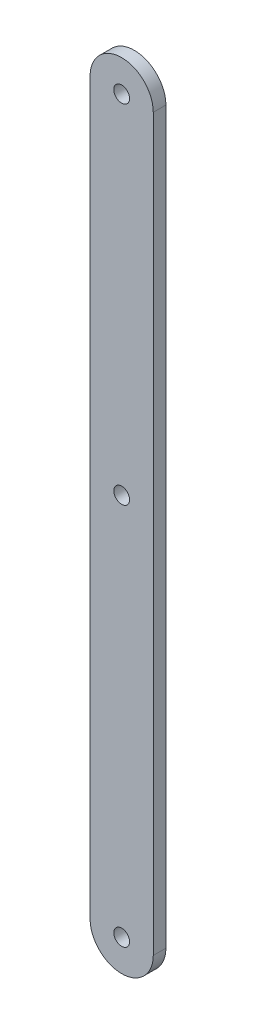
ISO-10303-21;
HEADER;
FILE_DESCRIPTION(('STEP AP214'),'2;1');
FILE_NAME('part.step','',(''),(''),'','','');
FILE_SCHEMA(('AUTOMOTIVE_DESIGN { 1 0 10303 214 1 1 1 1 }'));
ENDSEC;
DATA;
#1=APPLICATION_CONTEXT('core data for automotive mechanical design processes');
#2=APPLICATION_PROTOCOL_DEFINITION('international standard','automotive_design',2000,#1);
#3=PRODUCT_CONTEXT('',#1,'mechanical');
#4=PRODUCT('Part','Part','',(#3));
#5=PRODUCT_RELATED_PRODUCT_CATEGORY('part','',(#4));
#6=PRODUCT_DEFINITION_FORMATION('','',#4);
#7=PRODUCT_DEFINITION_CONTEXT('part definition',#1,'design');
#8=PRODUCT_DEFINITION('design','',#6,#7);
#9=PRODUCT_DEFINITION_SHAPE('','',#8);
#10=(LENGTH_UNIT() NAMED_UNIT(*) SI_UNIT(.MILLI.,.METRE.));
#11=(NAMED_UNIT(*) PLANE_ANGLE_UNIT() SI_UNIT($,.RADIAN.));
#12=(NAMED_UNIT(*) SI_UNIT($,.STERADIAN.) SOLID_ANGLE_UNIT());
#13=UNCERTAINTY_MEASURE_WITH_UNIT(LENGTH_MEASURE(1.E-05),#10,'distance_accuracy_value','');
#14=(GEOMETRIC_REPRESENTATION_CONTEXT(3) GLOBAL_UNCERTAINTY_ASSIGNED_CONTEXT((#13)) GLOBAL_UNIT_ASSIGNED_CONTEXT((#10,
#11,#12)) REPRESENTATION_CONTEXT('',''));
#15=CARTESIAN_POINT('',(0.,0.,0.));
#16=DIRECTION('',(0.,0.,1.));
#17=DIRECTION('',(1.,0.,0.));
#18=AXIS2_PLACEMENT_3D('',#15,#16,#17);
#19=CARTESIAN_POINT('',(0.,0.,2.54));
#20=DIRECTION('',(0.,0.,1.));
#21=DIRECTION('',(1.,0.,0.));
#22=AXIS2_PLACEMENT_3D('',#19,#20,#21);
#23=PLANE('',#22);
#24=CARTESIAN_POINT('',(0.,76.962,2.54));
#25=DIRECTION('',(0.,0.,1.));
#26=DIRECTION('',(1.,0.,0.));
#27=AXIS2_PLACEMENT_3D('',#24,#25,#26);
#28=CIRCLE('',#27,1.5875);
#29=CARTESIAN_POINT('',(1.5875,76.962,2.54));
#30=VERTEX_POINT('',#29);
#31=EDGE_CURVE('E114',#30,#30,#28,.T.);
#32=ORIENTED_EDGE('',*,*,#31,.F.);
#33=EDGE_LOOP('',(#32));
#34=FACE_BOUND('',#33,.T.);
#35=CARTESIAN_POINT('',(0.,0.,2.54));
#36=DIRECTION('',(0.,0.,1.));
#37=DIRECTION('',(1.,0.,0.));
#38=AXIS2_PLACEMENT_3D('',#35,#36,#37);
#39=CIRCLE('',#38,6.35);
#40=CARTESIAN_POINT('',(-6.35,0.,2.54));
#41=VERTEX_POINT('',#40);
#42=CARTESIAN_POINT('',(6.35,0.,2.54));
#43=VERTEX_POINT('',#42);
#44=EDGE_CURVE('E84',#41,#43,#39,.T.);
#45=ORIENTED_EDGE('',*,*,#44,.T.);
#46=DIRECTION('',(0.,1.,0.));
#47=VECTOR('',#46,1.);
#48=CARTESIAN_POINT('',(6.35,0.,2.54));
#49=LINE('',#48,#47);
#50=CARTESIAN_POINT('',(6.35,146.812,2.54));
#51=VERTEX_POINT('',#50);
#52=EDGE_CURVE('E79',#43,#51,#49,.T.);
#53=ORIENTED_EDGE('',*,*,#52,.T.);
#54=CARTESIAN_POINT('',(0.,146.812,2.54));
#55=DIRECTION('',(0.,0.,1.));
#56=DIRECTION('',(1.,0.,0.));
#57=AXIS2_PLACEMENT_3D('',#54,#55,#56);
#58=CIRCLE('',#57,6.35);
#59=CARTESIAN_POINT('',(-6.35,146.812,2.54));
#60=VERTEX_POINT('',#59);
#61=EDGE_CURVE('E82',#51,#60,#58,.T.);
#62=ORIENTED_EDGE('',*,*,#61,.T.);
#63=DIRECTION('',(0.,-1.,0.));
#64=VECTOR('',#63,1.);
#65=CARTESIAN_POINT('',(-6.35,0.,2.54));
#66=LINE('',#65,#64);
#67=EDGE_CURVE('E49',#60,#41,#66,.T.);
#68=ORIENTED_EDGE('',*,*,#67,.T.);
#69=EDGE_LOOP('',(#45,#53,#62,#68));
#70=FACE_BOUND('',#69,.T.);
#71=CARTESIAN_POINT('',(0.,0.,2.54));
#72=DIRECTION('',(0.,0.,1.));
#73=DIRECTION('',(1.,0.,0.));
#74=AXIS2_PLACEMENT_3D('',#71,#72,#73);
#75=CIRCLE('',#74,1.5875);
#76=CARTESIAN_POINT('',(1.5875,0.,2.54));
#77=VERTEX_POINT('',#76);
#78=EDGE_CURVE('E99',#77,#77,#75,.T.);
#79=ORIENTED_EDGE('',*,*,#78,.F.);
#80=EDGE_LOOP('',(#79));
#81=FACE_BOUND('',#80,.T.);
#82=CARTESIAN_POINT('',(0.,146.812,2.54));
#83=DIRECTION('',(0.,0.,1.));
#84=DIRECTION('',(1.,0.,0.));
#85=AXIS2_PLACEMENT_3D('',#82,#83,#84);
#86=CIRCLE('',#85,1.5875);
#87=CARTESIAN_POINT('',(1.5875,146.812,2.54));
#88=VERTEX_POINT('',#87);
#89=EDGE_CURVE('E120',#88,#88,#86,.T.);
#90=ORIENTED_EDGE('',*,*,#89,.F.);
#91=EDGE_LOOP('',(#90));
#92=FACE_BOUND('',#91,.T.);
#93=ADVANCED_FACE('F32',(#34,#70,#81,#92),#23,.T.);
#94=CARTESIAN_POINT('',(0.,0.,0.));
#95=DIRECTION('',(0.,0.,1.));
#96=DIRECTION('',(1.,0.,0.));
#97=AXIS2_PLACEMENT_3D('',#94,#95,#96);
#98=PLANE('',#97);
#99=CARTESIAN_POINT('',(0.,0.,0.));
#100=DIRECTION('',(0.,0.,1.));
#101=DIRECTION('',(1.,0.,0.));
#102=AXIS2_PLACEMENT_3D('',#99,#100,#101);
#103=CIRCLE('',#102,6.35);
#104=CARTESIAN_POINT('',(-6.35,0.,0.));
#105=VERTEX_POINT('',#104);
#106=CARTESIAN_POINT('',(6.35,0.,0.));
#107=VERTEX_POINT('',#106);
#108=EDGE_CURVE('E96',#105,#107,#103,.T.);
#109=ORIENTED_EDGE('',*,*,#108,.F.);
#110=DIRECTION('',(0.,-1.,0.));
#111=VECTOR('',#110,1.);
#112=CARTESIAN_POINT('',(-6.35,0.,0.));
#113=LINE('',#112,#111);
#114=CARTESIAN_POINT('',(-6.35,146.812,0.));
#115=VERTEX_POINT('',#114);
#116=EDGE_CURVE('E72',#115,#105,#113,.T.);
#117=ORIENTED_EDGE('',*,*,#116,.F.);
#118=CARTESIAN_POINT('',(0.,146.812,0.));
#119=DIRECTION('',(0.,0.,1.));
#120=DIRECTION('',(1.,0.,0.));
#121=AXIS2_PLACEMENT_3D('',#118,#119,#120);
#122=CIRCLE('',#121,6.35);
#123=CARTESIAN_POINT('',(6.35,146.812,0.));
#124=VERTEX_POINT('',#123);
#125=EDGE_CURVE('E66',#124,#115,#122,.T.);
#126=ORIENTED_EDGE('',*,*,#125,.F.);
#127=DIRECTION('',(0.,1.,0.));
#128=VECTOR('',#127,1.);
#129=CARTESIAN_POINT('',(6.35,0.,0.));
#130=LINE('',#129,#128);
#131=EDGE_CURVE('E88',#107,#124,#130,.T.);
#132=ORIENTED_EDGE('',*,*,#131,.F.);
#133=EDGE_LOOP('',(#109,#117,#126,#132));
#134=FACE_BOUND('',#133,.T.);
#135=CARTESIAN_POINT('',(0.,0.,0.));
#136=DIRECTION('',(0.,0.,1.));
#137=DIRECTION('',(1.,0.,0.));
#138=AXIS2_PLACEMENT_3D('',#135,#136,#137);
#139=CIRCLE('',#138,1.5875);
#140=CARTESIAN_POINT('',(1.5875,0.,0.));
#141=VERTEX_POINT('',#140);
#142=EDGE_CURVE('E111',#141,#141,#139,.T.);
#143=ORIENTED_EDGE('',*,*,#142,.T.);
#144=EDGE_LOOP('',(#143));
#145=FACE_BOUND('',#144,.T.);
#146=CARTESIAN_POINT('',(0.,76.962,0.));
#147=DIRECTION('',(0.,0.,1.));
#148=DIRECTION('',(1.,0.,0.));
#149=AXIS2_PLACEMENT_3D('',#146,#147,#148);
#150=CIRCLE('',#149,1.5875);
#151=CARTESIAN_POINT('',(1.5875,76.962,0.));
#152=VERTEX_POINT('',#151);
#153=EDGE_CURVE('E117',#152,#152,#150,.T.);
#154=ORIENTED_EDGE('',*,*,#153,.T.);
#155=EDGE_LOOP('',(#154));
#156=FACE_BOUND('',#155,.T.);
#157=CARTESIAN_POINT('',(0.,146.812,0.));
#158=DIRECTION('',(0.,0.,1.));
#159=DIRECTION('',(1.,0.,0.));
#160=AXIS2_PLACEMENT_3D('',#157,#158,#159);
#161=CIRCLE('',#160,1.5875);
#162=CARTESIAN_POINT('',(1.5875,146.812,0.));
#163=VERTEX_POINT('',#162);
#164=EDGE_CURVE('E123',#163,#163,#161,.T.);
#165=ORIENTED_EDGE('',*,*,#164,.T.);
#166=EDGE_LOOP('',(#165));
#167=FACE_BOUND('',#166,.T.);
#168=ADVANCED_FACE('F107',(#134,#145,#156,#167),#98,.F.);
#169=CARTESIAN_POINT('',(0.,0.,2.54));
#170=DIRECTION('',(0.,0.,-1.));
#171=DIRECTION('',(-1.,0.,0.));
#172=AXIS2_PLACEMENT_3D('',#169,#170,#171);
#173=CYLINDRICAL_SURFACE('',#172,6.35);
#174=ORIENTED_EDGE('',*,*,#108,.T.);
#175=DIRECTION('',(0.,0.,-1.));
#176=VECTOR('',#175,1.);
#177=CARTESIAN_POINT('',(6.35,0.,2.54));
#178=LINE('',#177,#176);
#179=EDGE_CURVE('E11',#43,#107,#178,.T.);
#180=ORIENTED_EDGE('',*,*,#179,.F.);
#181=ORIENTED_EDGE('',*,*,#44,.F.);
#182=DIRECTION('',(0.,0.,-1.));
#183=VECTOR('',#182,1.);
#184=CARTESIAN_POINT('',(-6.35,0.,2.54));
#185=LINE('',#184,#183);
#186=EDGE_CURVE('E92',#41,#105,#185,.T.);
#187=ORIENTED_EDGE('',*,*,#186,.T.);
#188=EDGE_LOOP('',(#174,#180,#181,#187));
#189=FACE_BOUND('',#188,.T.);
#190=ADVANCED_FACE('F34',(#189),#173,.T.);
#191=CARTESIAN_POINT('',(6.35,0.,2.54));
#192=DIRECTION('',(-1.,0.,0.));
#193=DIRECTION('',(0.,0.,1.));
#194=AXIS2_PLACEMENT_3D('',#191,#192,#193);
#195=PLANE('',#194);
#196=ORIENTED_EDGE('',*,*,#131,.T.);
#197=DIRECTION('',(0.,0.,-1.));
#198=VECTOR('',#197,1.);
#199=CARTESIAN_POINT('',(6.35,146.812,2.54));
#200=LINE('',#199,#198);
#201=EDGE_CURVE('E41',#51,#124,#200,.T.);
#202=ORIENTED_EDGE('',*,*,#201,.F.);
#203=ORIENTED_EDGE('',*,*,#52,.F.);
#204=ORIENTED_EDGE('',*,*,#179,.T.);
#205=EDGE_LOOP('',(#196,#202,#203,#204));
#206=FACE_BOUND('',#205,.T.);
#207=ADVANCED_FACE('F87',(#206),#195,.F.);
#208=CARTESIAN_POINT('',(0.,146.812,2.54));
#209=DIRECTION('',(0.,0.,-1.));
#210=DIRECTION('',(-1.,0.,0.));
#211=AXIS2_PLACEMENT_3D('',#208,#209,#210);
#212=CYLINDRICAL_SURFACE('',#211,6.35);
#213=ORIENTED_EDGE('',*,*,#125,.T.);
#214=DIRECTION('',(0.,0.,-1.));
#215=VECTOR('',#214,1.);
#216=CARTESIAN_POINT('',(-6.35,146.812,2.54));
#217=LINE('',#216,#215);
#218=EDGE_CURVE('E89',#60,#115,#217,.T.);
#219=ORIENTED_EDGE('',*,*,#218,.F.);
#220=ORIENTED_EDGE('',*,*,#61,.F.);
#221=ORIENTED_EDGE('',*,*,#201,.T.);
#222=EDGE_LOOP('',(#213,#219,#220,#221));
#223=FACE_BOUND('',#222,.T.);
#224=ADVANCED_FACE('F90',(#223),#212,.T.);
#225=CARTESIAN_POINT('',(-6.35,0.,2.54));
#226=DIRECTION('',(1.,0.,0.));
#227=DIRECTION('',(0.,0.,-1.));
#228=AXIS2_PLACEMENT_3D('',#225,#226,#227);
#229=PLANE('',#228);
#230=ORIENTED_EDGE('',*,*,#116,.T.);
#231=ORIENTED_EDGE('',*,*,#186,.F.);
#232=ORIENTED_EDGE('',*,*,#67,.F.);
#233=ORIENTED_EDGE('',*,*,#218,.T.);
#234=EDGE_LOOP('',(#230,#231,#232,#233));
#235=FACE_BOUND('',#234,.T.);
#236=ADVANCED_FACE('F104',(#235),#229,.F.);
#237=CARTESIAN_POINT('',(0.,0.,2.54));
#238=DIRECTION('',(0.,0.,-1.));
#239=DIRECTION('',(-1.,0.,0.));
#240=AXIS2_PLACEMENT_3D('',#237,#238,#239);
#241=CYLINDRICAL_SURFACE('',#240,1.5875);
#242=ORIENTED_EDGE('',*,*,#78,.T.);
#243=EDGE_LOOP('',(#242));
#244=FACE_BOUND('',#243,.T.);
#245=ORIENTED_EDGE('',*,*,#142,.F.);
#246=EDGE_LOOP('',(#245));
#247=FACE_BOUND('',#246,.T.);
#248=ADVANCED_FACE('F141',(#244,#247),#241,.F.);
#249=CARTESIAN_POINT('',(0.,76.962,2.54));
#250=DIRECTION('',(0.,0.,-1.));
#251=DIRECTION('',(-1.,0.,0.));
#252=AXIS2_PLACEMENT_3D('',#249,#250,#251);
#253=CYLINDRICAL_SURFACE('',#252,1.5875);
#254=ORIENTED_EDGE('',*,*,#31,.T.);
#255=EDGE_LOOP('',(#254));
#256=FACE_BOUND('',#255,.T.);
#257=ORIENTED_EDGE('',*,*,#153,.F.);
#258=EDGE_LOOP('',(#257));
#259=FACE_BOUND('',#258,.T.);
#260=ADVANCED_FACE('F187',(#256,#259),#253,.F.);
#261=CARTESIAN_POINT('',(0.,146.812,2.54));
#262=DIRECTION('',(0.,0.,-1.));
#263=DIRECTION('',(-1.,0.,0.));
#264=AXIS2_PLACEMENT_3D('',#261,#262,#263);
#265=CYLINDRICAL_SURFACE('',#264,1.5875);
#266=ORIENTED_EDGE('',*,*,#89,.T.);
#267=EDGE_LOOP('',(#266));
#268=FACE_BOUND('',#267,.T.);
#269=ORIENTED_EDGE('',*,*,#164,.F.);
#270=EDGE_LOOP('',(#269));
#271=FACE_BOUND('',#270,.T.);
#272=ADVANCED_FACE('F129',(#268,#271),#265,.F.);
#273=CLOSED_SHELL('',(#93,#168,#190,#207,#224,#236,#248,#260,#272));
#274=MANIFOLD_SOLID_BREP('B2',#273);
#275=ADVANCED_BREP_SHAPE_REPRESENTATION('',(#18,#274),#14);
#276=SHAPE_DEFINITION_REPRESENTATION(#9,#275);
ENDSEC;
END-ISO-10303-21;
